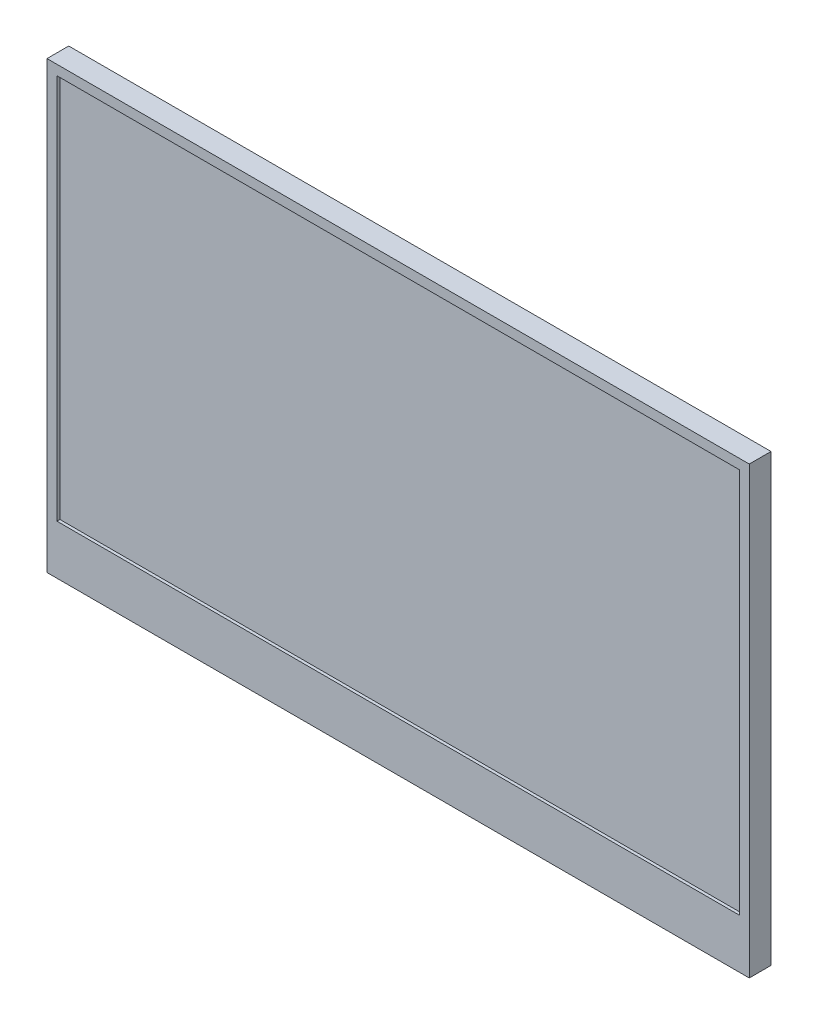
ISO-10303-21;
HEADER;
FILE_DESCRIPTION(('STEP AP214'),'2;1');
FILE_NAME('part.step','',(''),(''),'','','');
FILE_SCHEMA(('AUTOMOTIVE_DESIGN { 1 0 10303 214 1 1 1 1 }'));
ENDSEC;
DATA;
#1=APPLICATION_CONTEXT('core data for automotive mechanical design processes');
#2=APPLICATION_PROTOCOL_DEFINITION('international standard','automotive_design',2000,#1);
#3=PRODUCT_CONTEXT('',#1,'mechanical');
#4=PRODUCT('Part','Part','',(#3));
#5=PRODUCT_RELATED_PRODUCT_CATEGORY('part','',(#4));
#6=PRODUCT_DEFINITION_FORMATION('','',#4);
#7=PRODUCT_DEFINITION_CONTEXT('part definition',#1,'design');
#8=PRODUCT_DEFINITION('design','',#6,#7);
#9=PRODUCT_DEFINITION_SHAPE('','',#8);
#10=(LENGTH_UNIT() NAMED_UNIT(*) SI_UNIT(.MILLI.,.METRE.));
#11=(NAMED_UNIT(*) PLANE_ANGLE_UNIT() SI_UNIT($,.RADIAN.));
#12=(NAMED_UNIT(*) SI_UNIT($,.STERADIAN.) SOLID_ANGLE_UNIT());
#13=UNCERTAINTY_MEASURE_WITH_UNIT(LENGTH_MEASURE(1.E-05),#10,'distance_accuracy_value','');
#14=(GEOMETRIC_REPRESENTATION_CONTEXT(3) GLOBAL_UNCERTAINTY_ASSIGNED_CONTEXT((#13)) GLOBAL_UNIT_ASSIGNED_CONTEXT((#10,
#11,#12)) REPRESENTATION_CONTEXT('',''));
#15=CARTESIAN_POINT('',(0.,0.,0.));
#16=DIRECTION('',(0.,0.,1.));
#17=DIRECTION('',(1.,0.,0.));
#18=AXIS2_PLACEMENT_3D('',#15,#16,#17);
#19=CARTESIAN_POINT('',(177.5,-112.5,11.));
#20=DIRECTION('',(-1.,0.,0.));
#21=DIRECTION('',(0.,0.,1.));
#22=AXIS2_PLACEMENT_3D('',#19,#20,#21);
#23=PLANE('',#22);
#24=DIRECTION('',(0.,1.,0.));
#25=VECTOR('',#24,1.);
#26=CARTESIAN_POINT('',(177.5,-112.5,0.));
#27=LINE('',#26,#25);
#28=CARTESIAN_POINT('',(177.5,-112.5,0.));
#29=VERTEX_POINT('',#28);
#30=CARTESIAN_POINT('',(177.5,112.5,0.));
#31=VERTEX_POINT('',#30);
#32=EDGE_CURVE('E141',#29,#31,#27,.T.);
#33=ORIENTED_EDGE('',*,*,#32,.T.);
#34=DIRECTION('',(0.,0.,-1.));
#35=VECTOR('',#34,1.);
#36=CARTESIAN_POINT('',(177.5,112.5,11.));
#37=LINE('',#36,#35);
#38=CARTESIAN_POINT('',(177.5,112.5,11.));
#39=VERTEX_POINT('',#38);
#40=EDGE_CURVE('E11',#39,#31,#37,.T.);
#41=ORIENTED_EDGE('',*,*,#40,.F.);
#42=DIRECTION('',(0.,1.,0.));
#43=VECTOR('',#42,1.);
#44=CARTESIAN_POINT('',(177.5,-112.5,11.));
#45=LINE('',#44,#43);
#46=CARTESIAN_POINT('',(177.5,-112.5,11.));
#47=VERTEX_POINT('',#46);
#48=EDGE_CURVE('E145',#47,#39,#45,.T.);
#49=ORIENTED_EDGE('',*,*,#48,.F.);
#50=DIRECTION('',(0.,0.,-1.));
#51=VECTOR('',#50,1.);
#52=CARTESIAN_POINT('',(177.5,-112.5,11.));
#53=LINE('',#52,#51);
#54=EDGE_CURVE('E151',#47,#29,#53,.T.);
#55=ORIENTED_EDGE('',*,*,#54,.T.);
#56=EDGE_LOOP('',(#33,#41,#49,#55));
#57=FACE_BOUND('',#56,.T.);
#58=ADVANCED_FACE('F33',(#57),#23,.F.);
#59=CARTESIAN_POINT('',(-177.5,112.5,11.));
#60=DIRECTION('',(0.,-1.,0.));
#61=DIRECTION('',(0.,0.,-1.));
#62=AXIS2_PLACEMENT_3D('',#59,#60,#61);
#63=PLANE('',#62);
#64=DIRECTION('',(-1.,0.,0.));
#65=VECTOR('',#64,1.);
#66=CARTESIAN_POINT('',(-177.5,112.5,0.));
#67=LINE('',#66,#65);
#68=CARTESIAN_POINT('',(-177.5,112.5,0.));
#69=VERTEX_POINT('',#68);
#70=EDGE_CURVE('E154',#31,#69,#67,.T.);
#71=ORIENTED_EDGE('',*,*,#70,.T.);
#72=DIRECTION('',(0.,0.,-1.));
#73=VECTOR('',#72,1.);
#74=CARTESIAN_POINT('',(-177.5,112.5,11.));
#75=LINE('',#74,#73);
#76=CARTESIAN_POINT('',(-177.5,112.5,11.));
#77=VERTEX_POINT('',#76);
#78=EDGE_CURVE('E40',#77,#69,#75,.T.);
#79=ORIENTED_EDGE('',*,*,#78,.F.);
#80=DIRECTION('',(-1.,0.,0.));
#81=VECTOR('',#80,1.);
#82=CARTESIAN_POINT('',(-177.5,112.5,11.));
#83=LINE('',#82,#81);
#84=EDGE_CURVE('E84',#39,#77,#83,.T.);
#85=ORIENTED_EDGE('',*,*,#84,.F.);
#86=ORIENTED_EDGE('',*,*,#40,.T.);
#87=EDGE_LOOP('',(#71,#79,#85,#86));
#88=FACE_BOUND('',#87,.T.);
#89=ADVANCED_FACE('F183',(#88),#63,.F.);
#90=CARTESIAN_POINT('',(-177.5,-112.5,11.));
#91=DIRECTION('',(1.,0.,0.));
#92=DIRECTION('',(0.,0.,-1.));
#93=AXIS2_PLACEMENT_3D('',#90,#91,#92);
#94=PLANE('',#93);
#95=DIRECTION('',(0.,-1.,0.));
#96=VECTOR('',#95,1.);
#97=CARTESIAN_POINT('',(-177.5,-112.5,0.));
#98=LINE('',#97,#96);
#99=CARTESIAN_POINT('',(-177.5,-112.5,0.));
#100=VERTEX_POINT('',#99);
#101=EDGE_CURVE('E156',#69,#100,#98,.T.);
#102=ORIENTED_EDGE('',*,*,#101,.T.);
#103=DIRECTION('',(0.,0.,-1.));
#104=VECTOR('',#103,1.);
#105=CARTESIAN_POINT('',(-177.5,-112.5,11.));
#106=LINE('',#105,#104);
#107=CARTESIAN_POINT('',(-177.5,-112.5,11.));
#108=VERTEX_POINT('',#107);
#109=EDGE_CURVE('E160',#108,#100,#106,.T.);
#110=ORIENTED_EDGE('',*,*,#109,.F.);
#111=DIRECTION('',(0.,-1.,0.));
#112=VECTOR('',#111,1.);
#113=CARTESIAN_POINT('',(-177.5,-112.5,11.));
#114=LINE('',#113,#112);
#115=EDGE_CURVE('E148',#77,#108,#114,.T.);
#116=ORIENTED_EDGE('',*,*,#115,.F.);
#117=ORIENTED_EDGE('',*,*,#78,.T.);
#118=EDGE_LOOP('',(#102,#110,#116,#117));
#119=FACE_BOUND('',#118,.T.);
#120=ADVANCED_FACE('F165',(#119),#94,.F.);
#121=CARTESIAN_POINT('',(-177.5,-112.5,11.));
#122=DIRECTION('',(0.,1.,0.));
#123=DIRECTION('',(0.,0.,1.));
#124=AXIS2_PLACEMENT_3D('',#121,#122,#123);
#125=PLANE('',#124);
#126=DIRECTION('',(1.,0.,0.));
#127=VECTOR('',#126,1.);
#128=CARTESIAN_POINT('',(-177.5,-112.5,0.));
#129=LINE('',#128,#127);
#130=EDGE_CURVE('E77',#100,#29,#129,.T.);
#131=ORIENTED_EDGE('',*,*,#130,.T.);
#132=ORIENTED_EDGE('',*,*,#54,.F.);
#133=DIRECTION('',(1.,0.,0.));
#134=VECTOR('',#133,1.);
#135=CARTESIAN_POINT('',(-177.5,-112.5,11.));
#136=LINE('',#135,#134);
#137=EDGE_CURVE('E56',#108,#47,#136,.T.);
#138=ORIENTED_EDGE('',*,*,#137,.F.);
#139=ORIENTED_EDGE('',*,*,#109,.T.);
#140=EDGE_LOOP('',(#131,#132,#138,#139));
#141=FACE_BOUND('',#140,.T.);
#142=ADVANCED_FACE('F173',(#141),#125,.F.);
#143=CARTESIAN_POINT('',(0.,0.,11.));
#144=DIRECTION('',(0.,0.,-1.));
#145=DIRECTION('',(-1.,0.,0.));
#146=AXIS2_PLACEMENT_3D('',#143,#144,#145);
#147=PLANE('',#146);
#148=DIRECTION('',(1.,0.,0.));
#149=VECTOR('',#148,1.);
#150=CARTESIAN_POINT('',(-172.5,-87.5,11.));
#151=LINE('',#150,#149);
#152=CARTESIAN_POINT('',(-172.5,-87.5,11.));
#153=VERTEX_POINT('',#152);
#154=CARTESIAN_POINT('',(172.5,-87.5,11.));
#155=VERTEX_POINT('',#154);
#156=EDGE_CURVE('E135',#153,#155,#151,.T.);
#157=ORIENTED_EDGE('',*,*,#156,.F.);
#158=DIRECTION('',(0.,-1.,0.));
#159=VECTOR('',#158,1.);
#160=CARTESIAN_POINT('',(-172.5,107.5,11.));
#161=LINE('',#160,#159);
#162=CARTESIAN_POINT('',(-172.5,107.5,11.));
#163=VERTEX_POINT('',#162);
#164=EDGE_CURVE('E47',#163,#153,#161,.T.);
#165=ORIENTED_EDGE('',*,*,#164,.F.);
#166=DIRECTION('',(-1.,0.,0.));
#167=VECTOR('',#166,1.);
#168=CARTESIAN_POINT('',(-172.5,107.5,11.));
#169=LINE('',#168,#167);
#170=CARTESIAN_POINT('',(172.5,107.5,11.));
#171=VERTEX_POINT('',#170);
#172=EDGE_CURVE('E126',#171,#163,#169,.T.);
#173=ORIENTED_EDGE('',*,*,#172,.F.);
#174=DIRECTION('',(0.,1.,0.));
#175=VECTOR('',#174,1.);
#176=CARTESIAN_POINT('',(172.5,107.5,11.));
#177=LINE('',#176,#175);
#178=EDGE_CURVE('E129',#155,#171,#177,.T.);
#179=ORIENTED_EDGE('',*,*,#178,.F.);
#180=EDGE_LOOP('',(#157,#165,#173,#179));
#181=FACE_BOUND('',#180,.T.);
#182=ORIENTED_EDGE('',*,*,#48,.T.);
#183=ORIENTED_EDGE('',*,*,#84,.T.);
#184=ORIENTED_EDGE('',*,*,#115,.T.);
#185=ORIENTED_EDGE('',*,*,#137,.T.);
#186=EDGE_LOOP('',(#182,#183,#184,#185));
#187=FACE_BOUND('',#186,.T.);
#188=ADVANCED_FACE('F175',(#181,#187),#147,.F.);
#189=CARTESIAN_POINT('',(0.,0.,0.));
#190=DIRECTION('',(0.,0.,-1.));
#191=DIRECTION('',(-1.,0.,0.));
#192=AXIS2_PLACEMENT_3D('',#189,#190,#191);
#193=PLANE('',#192);
#194=ORIENTED_EDGE('',*,*,#32,.F.);
#195=ORIENTED_EDGE('',*,*,#130,.F.);
#196=ORIENTED_EDGE('',*,*,#101,.F.);
#197=ORIENTED_EDGE('',*,*,#70,.F.);
#198=EDGE_LOOP('',(#194,#195,#196,#197));
#199=FACE_BOUND('',#198,.T.);
#200=ADVANCED_FACE('F169',(#199),#193,.T.);
#201=CARTESIAN_POINT('',(-172.5,107.5,9.5));
#202=DIRECTION('',(-1.,0.,0.));
#203=DIRECTION('',(0.,-1.,0.));
#204=AXIS2_PLACEMENT_3D('',#201,#202,#203);
#205=PLANE('',#204);
#206=ORIENTED_EDGE('',*,*,#164,.T.);
#207=DIRECTION('',(0.,0.,1.));
#208=VECTOR('',#207,1.);
#209=CARTESIAN_POINT('',(-172.5,-87.5,9.5));
#210=LINE('',#209,#208);
#211=CARTESIAN_POINT('',(-172.5,-87.5,9.5));
#212=VERTEX_POINT('',#211);
#213=EDGE_CURVE('E104',#212,#153,#210,.T.);
#214=ORIENTED_EDGE('',*,*,#213,.F.);
#215=DIRECTION('',(0.,-1.,0.));
#216=VECTOR('',#215,1.);
#217=CARTESIAN_POINT('',(-172.5,107.5,9.5));
#218=LINE('',#217,#216);
#219=CARTESIAN_POINT('',(-172.5,107.5,9.5));
#220=VERTEX_POINT('',#219);
#221=EDGE_CURVE('E108',#220,#212,#218,.T.);
#222=ORIENTED_EDGE('',*,*,#221,.F.);
#223=DIRECTION('',(0.,0.,1.));
#224=VECTOR('',#223,1.);
#225=CARTESIAN_POINT('',(-172.5,107.5,9.5));
#226=LINE('',#225,#224);
#227=EDGE_CURVE('E139',#220,#163,#226,.T.);
#228=ORIENTED_EDGE('',*,*,#227,.T.);
#229=EDGE_LOOP('',(#206,#214,#222,#228));
#230=FACE_BOUND('',#229,.T.);
#231=ADVANCED_FACE('F106',(#230),#205,.F.);
#232=CARTESIAN_POINT('',(-172.5,107.5,9.5));
#233=DIRECTION('',(0.,1.,0.));
#234=DIRECTION('',(-1.,0.,0.));
#235=AXIS2_PLACEMENT_3D('',#232,#233,#234);
#236=PLANE('',#235);
#237=ORIENTED_EDGE('',*,*,#172,.T.);
#238=ORIENTED_EDGE('',*,*,#227,.F.);
#239=DIRECTION('',(-1.,0.,0.));
#240=VECTOR('',#239,1.);
#241=CARTESIAN_POINT('',(-172.5,107.5,9.5));
#242=LINE('',#241,#240);
#243=CARTESIAN_POINT('',(172.5,107.5,9.5));
#244=VERTEX_POINT('',#243);
#245=EDGE_CURVE('E114',#244,#220,#242,.T.);
#246=ORIENTED_EDGE('',*,*,#245,.F.);
#247=DIRECTION('',(0.,0.,1.));
#248=VECTOR('',#247,1.);
#249=CARTESIAN_POINT('',(172.5,107.5,9.5));
#250=LINE('',#249,#248);
#251=EDGE_CURVE('E142',#244,#171,#250,.T.);
#252=ORIENTED_EDGE('',*,*,#251,.T.);
#253=EDGE_LOOP('',(#237,#238,#246,#252));
#254=FACE_BOUND('',#253,.T.);
#255=ADVANCED_FACE('F222',(#254),#236,.F.);
#256=CARTESIAN_POINT('',(172.5,107.5,9.5));
#257=DIRECTION('',(1.,0.,0.));
#258=DIRECTION('',(0.,1.,0.));
#259=AXIS2_PLACEMENT_3D('',#256,#257,#258);
#260=PLANE('',#259);
#261=ORIENTED_EDGE('',*,*,#178,.T.);
#262=ORIENTED_EDGE('',*,*,#251,.F.);
#263=DIRECTION('',(0.,1.,0.));
#264=VECTOR('',#263,1.);
#265=CARTESIAN_POINT('',(172.5,107.5,9.5));
#266=LINE('',#265,#264);
#267=CARTESIAN_POINT('',(172.5,-87.5,9.5));
#268=VERTEX_POINT('',#267);
#269=EDGE_CURVE('E122',#268,#244,#266,.T.);
#270=ORIENTED_EDGE('',*,*,#269,.F.);
#271=DIRECTION('',(0.,0.,1.));
#272=VECTOR('',#271,1.);
#273=CARTESIAN_POINT('',(172.5,-87.5,9.5));
#274=LINE('',#273,#272);
#275=EDGE_CURVE('E113',#268,#155,#274,.T.);
#276=ORIENTED_EDGE('',*,*,#275,.T.);
#277=EDGE_LOOP('',(#261,#262,#270,#276));
#278=FACE_BOUND('',#277,.T.);
#279=ADVANCED_FACE('F231',(#278),#260,.F.);
#280=CARTESIAN_POINT('',(-172.5,-87.5,9.5));
#281=DIRECTION('',(0.,-1.,0.));
#282=DIRECTION('',(0.,0.,-1.));
#283=AXIS2_PLACEMENT_3D('',#280,#281,#282);
#284=PLANE('',#283);
#285=ORIENTED_EDGE('',*,*,#156,.T.);
#286=ORIENTED_EDGE('',*,*,#275,.F.);
#287=DIRECTION('',(1.,0.,0.));
#288=VECTOR('',#287,1.);
#289=CARTESIAN_POINT('',(-172.5,-87.5,9.5));
#290=LINE('',#289,#288);
#291=EDGE_CURVE('E117',#212,#268,#290,.T.);
#292=ORIENTED_EDGE('',*,*,#291,.F.);
#293=ORIENTED_EDGE('',*,*,#213,.T.);
#294=EDGE_LOOP('',(#285,#286,#292,#293));
#295=FACE_BOUND('',#294,.T.);
#296=ADVANCED_FACE('F118',(#295),#284,.F.);
#297=CARTESIAN_POINT('',(0.,0.,9.5));
#298=DIRECTION('',(0.,0.,1.));
#299=DIRECTION('',(1.,0.,0.));
#300=AXIS2_PLACEMENT_3D('',#297,#298,#299);
#301=PLANE('',#300);
#302=ORIENTED_EDGE('',*,*,#221,.T.);
#303=ORIENTED_EDGE('',*,*,#291,.T.);
#304=ORIENTED_EDGE('',*,*,#269,.T.);
#305=ORIENTED_EDGE('',*,*,#245,.T.);
#306=EDGE_LOOP('',(#302,#303,#304,#305));
#307=FACE_BOUND('',#306,.T.);
#308=ADVANCED_FACE('F124',(#307),#301,.T.);
#309=CLOSED_SHELL('',(#58,#89,#120,#142,#188,#200,#231,#255,#279,#296,#308));
#310=MANIFOLD_SOLID_BREP('B2',#309);
#311=ADVANCED_BREP_SHAPE_REPRESENTATION('',(#18,#310),#14);
#312=SHAPE_DEFINITION_REPRESENTATION(#9,#311);
ENDSEC;
END-ISO-10303-21;
